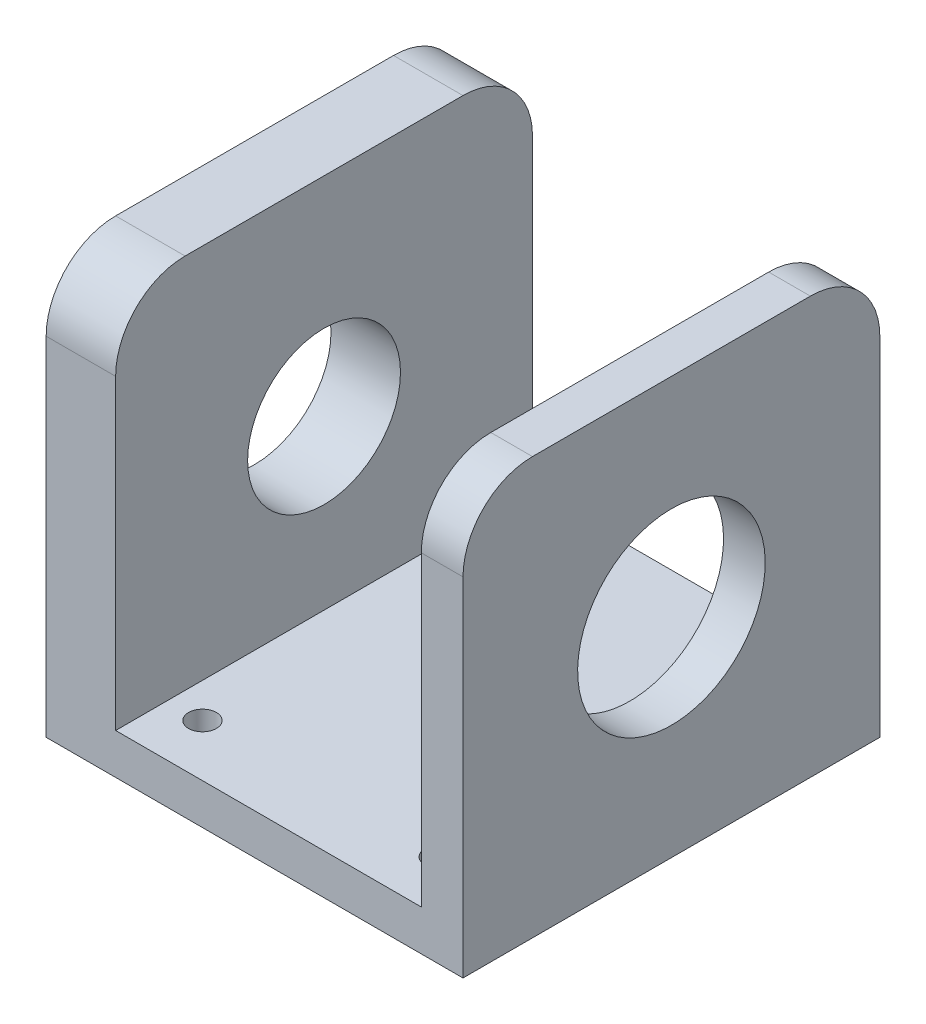
ISO-10303-21;
HEADER;
FILE_DESCRIPTION(('STEP AP214'),'2;1');
FILE_NAME('part.step','',(''),(''),'','','');
FILE_SCHEMA(('AUTOMOTIVE_DESIGN { 1 0 10303 214 1 1 1 1 }'));
ENDSEC;
DATA;
#1=APPLICATION_CONTEXT('core data for automotive mechanical design processes');
#2=APPLICATION_PROTOCOL_DEFINITION('international standard','automotive_design',2000,#1);
#3=PRODUCT_CONTEXT('',#1,'mechanical');
#4=PRODUCT('Part','Part','',(#3));
#5=PRODUCT_RELATED_PRODUCT_CATEGORY('part','',(#4));
#6=PRODUCT_DEFINITION_FORMATION('','',#4);
#7=PRODUCT_DEFINITION_CONTEXT('part definition',#1,'design');
#8=PRODUCT_DEFINITION('design','',#6,#7);
#9=PRODUCT_DEFINITION_SHAPE('','',#8);
#10=(LENGTH_UNIT() NAMED_UNIT(*) SI_UNIT(.MILLI.,.METRE.));
#11=(NAMED_UNIT(*) PLANE_ANGLE_UNIT() SI_UNIT($,.RADIAN.));
#12=(NAMED_UNIT(*) SI_UNIT($,.STERADIAN.) SOLID_ANGLE_UNIT());
#13=UNCERTAINTY_MEASURE_WITH_UNIT(LENGTH_MEASURE(1.E-05),#10,'distance_accuracy_value','');
#14=(GEOMETRIC_REPRESENTATION_CONTEXT(3) GLOBAL_UNCERTAINTY_ASSIGNED_CONTEXT((#13)) GLOBAL_UNIT_ASSIGNED_CONTEXT((#10,
#11,#12)) REPRESENTATION_CONTEXT('',''));
#15=CARTESIAN_POINT('',(0.,0.,0.));
#16=DIRECTION('',(0.,0.,1.));
#17=DIRECTION('',(1.,0.,0.));
#18=AXIS2_PLACEMENT_3D('',#15,#16,#17);
#19=CARTESIAN_POINT('',(-30.,30.,30.));
#20=DIRECTION('',(0.,-1.,0.));
#21=DIRECTION('',(1.,0.,0.));
#22=AXIS2_PLACEMENT_3D('',#19,#20,#21);
#23=PLANE('',#22);
#24=DIRECTION('',(0.,0.,-1.));
#25=VECTOR('',#24,1.);
#26=CARTESIAN_POINT('',(-20.,30.,30.));
#27=LINE('',#26,#25);
#28=CARTESIAN_POINT('',(-20.,30.,20.));
#29=VERTEX_POINT('',#28);
#30=CARTESIAN_POINT('',(-20.,30.,-20.));
#31=VERTEX_POINT('',#30);
#32=EDGE_CURVE('E162',#29,#31,#27,.T.);
#33=ORIENTED_EDGE('',*,*,#32,.T.);
#34=DIRECTION('',(-1.,0.,0.));
#35=VECTOR('',#34,1.);
#36=CARTESIAN_POINT('',(-30.,30.,-20.));
#37=LINE('',#36,#35);
#38=CARTESIAN_POINT('',(-30.,30.,-20.));
#39=VERTEX_POINT('',#38);
#40=EDGE_CURVE('E216',#31,#39,#37,.T.);
#41=ORIENTED_EDGE('',*,*,#40,.T.);
#42=DIRECTION('',(0.,0.,-1.));
#43=VECTOR('',#42,1.);
#44=CARTESIAN_POINT('',(-30.,30.,30.));
#45=LINE('',#44,#43);
#46=CARTESIAN_POINT('',(-30.,30.,20.));
#47=VERTEX_POINT('',#46);
#48=EDGE_CURVE('E145',#47,#39,#45,.T.);
#49=ORIENTED_EDGE('',*,*,#48,.F.);
#50=DIRECTION('',(-1.,0.,0.));
#51=VECTOR('',#50,1.);
#52=CARTESIAN_POINT('',(-30.,30.,20.));
#53=LINE('',#52,#51);
#54=EDGE_CURVE('E55',#47,#29,#53,.F.);
#55=ORIENTED_EDGE('',*,*,#54,.T.);
#56=EDGE_LOOP('',(#33,#41,#49,#55));
#57=FACE_BOUND('',#56,.T.);
#58=ADVANCED_FACE('F33',(#57),#23,.F.);
#59=CARTESIAN_POINT('',(-30.,30.,30.));
#60=DIRECTION('',(1.,0.,0.));
#61=DIRECTION('',(0.,1.,0.));
#62=AXIS2_PLACEMENT_3D('',#59,#60,#61);
#63=PLANE('',#62);
#64=CARTESIAN_POINT('',(-30.,0.,0.));
#65=DIRECTION('',(1.,0.,0.));
#66=DIRECTION('',(0.,1.,0.));
#67=AXIS2_PLACEMENT_3D('',#64,#65,#66);
#68=CIRCLE('',#67,11.);
#69=CARTESIAN_POINT('',(-30.,11.,0.));
#70=VERTEX_POINT('',#69);
#71=EDGE_CURVE('E165',#70,#70,#68,.T.);
#72=ORIENTED_EDGE('',*,*,#71,.T.);
#73=EDGE_LOOP('',(#72));
#74=FACE_BOUND('',#73,.T.);
#75=ORIENTED_EDGE('',*,*,#48,.T.);
#76=CARTESIAN_POINT('',(-30.,20.,-20.));
#77=DIRECTION('',(1.,0.,0.));
#78=DIRECTION('',(0.,1.,0.));
#79=AXIS2_PLACEMENT_3D('',#76,#77,#78);
#80=CIRCLE('',#79,10.);
#81=CARTESIAN_POINT('',(-30.,20.,-30.));
#82=VERTEX_POINT('',#81);
#83=EDGE_CURVE('E221',#39,#82,#80,.F.);
#84=ORIENTED_EDGE('',*,*,#83,.T.);
#85=DIRECTION('',(0.,-1.,0.));
#86=VECTOR('',#85,1.);
#87=CARTESIAN_POINT('',(-30.,30.,-30.));
#88=LINE('',#87,#86);
#89=CARTESIAN_POINT('',(-30.,-30.,-30.));
#90=VERTEX_POINT('',#89);
#91=EDGE_CURVE('E142',#82,#90,#88,.T.);
#92=ORIENTED_EDGE('',*,*,#91,.T.);
#93=DIRECTION('',(0.,0.,-1.));
#94=VECTOR('',#93,1.);
#95=CARTESIAN_POINT('',(-30.,-30.,30.));
#96=LINE('',#95,#94);
#97=CARTESIAN_POINT('',(-30.,-30.,30.));
#98=VERTEX_POINT('',#97);
#99=EDGE_CURVE('E138',#98,#90,#96,.T.);
#100=ORIENTED_EDGE('',*,*,#99,.F.);
#101=DIRECTION('',(0.,-1.,0.));
#102=VECTOR('',#101,1.);
#103=CARTESIAN_POINT('',(-30.,30.,30.));
#104=LINE('',#103,#102);
#105=CARTESIAN_POINT('',(-30.,20.,30.));
#106=VERTEX_POINT('',#105);
#107=EDGE_CURVE('E124',#106,#98,#104,.T.);
#108=ORIENTED_EDGE('',*,*,#107,.F.);
#109=CARTESIAN_POINT('',(-30.,20.,20.));
#110=DIRECTION('',(1.,0.,0.));
#111=DIRECTION('',(0.,1.,0.));
#112=AXIS2_PLACEMENT_3D('',#109,#110,#111);
#113=CIRCLE('',#112,10.);
#114=EDGE_CURVE('E219',#106,#47,#113,.F.);
#115=ORIENTED_EDGE('',*,*,#114,.T.);
#116=EDGE_LOOP('',(#75,#84,#92,#100,#108,#115));
#117=FACE_BOUND('',#116,.T.);
#118=ADVANCED_FACE('F140',(#74,#117),#63,.F.);
#119=CARTESIAN_POINT('',(-30.,-30.,30.));
#120=DIRECTION('',(0.,1.,0.));
#121=DIRECTION('',(0.,0.,1.));
#122=AXIS2_PLACEMENT_3D('',#119,#120,#121);
#123=PLANE('',#122);
#124=CARTESIAN_POINT('',(19.,-30.,-22.5));
#125=DIRECTION('',(0.,1.,0.));
#126=DIRECTION('',(0.,0.,1.));
#127=AXIS2_PLACEMENT_3D('',#124,#125,#126);
#128=CIRCLE('',#127,2.00000000000001);
#129=CARTESIAN_POINT('',(19.,-30.,-20.5));
#130=VERTEX_POINT('',#129);
#131=EDGE_CURVE('E193',#130,#130,#128,.T.);
#132=ORIENTED_EDGE('',*,*,#131,.T.);
#133=EDGE_LOOP('',(#132));
#134=FACE_BOUND('',#133,.T.);
#135=CARTESIAN_POINT('',(-15.,-30.,22.5));
#136=DIRECTION('',(0.,1.,0.));
#137=DIRECTION('',(0.,0.,1.));
#138=AXIS2_PLACEMENT_3D('',#135,#136,#137);
#139=CIRCLE('',#138,2.);
#140=CARTESIAN_POINT('',(-15.,-30.,24.5));
#141=VERTEX_POINT('',#140);
#142=EDGE_CURVE('E234',#141,#141,#139,.T.);
#143=ORIENTED_EDGE('',*,*,#142,.T.);
#144=EDGE_LOOP('',(#143));
#145=FACE_BOUND('',#144,.T.);
#146=CARTESIAN_POINT('',(19.,-30.,22.5));
#147=DIRECTION('',(0.,1.,0.));
#148=DIRECTION('',(0.,0.,1.));
#149=AXIS2_PLACEMENT_3D('',#146,#147,#148);
#150=CIRCLE('',#149,2.00000000000001);
#151=CARTESIAN_POINT('',(19.,-30.,24.5));
#152=VERTEX_POINT('',#151);
#153=EDGE_CURVE('E231',#152,#152,#150,.T.);
#154=ORIENTED_EDGE('',*,*,#153,.T.);
#155=EDGE_LOOP('',(#154));
#156=FACE_BOUND('',#155,.T.);
#157=CARTESIAN_POINT('',(-15.,-30.,-22.5));
#158=DIRECTION('',(0.,1.,0.));
#159=DIRECTION('',(0.,0.,1.));
#160=AXIS2_PLACEMENT_3D('',#157,#158,#159);
#161=CIRCLE('',#160,2.);
#162=CARTESIAN_POINT('',(-15.,-30.,-20.5));
#163=VERTEX_POINT('',#162);
#164=EDGE_CURVE('E227',#163,#163,#161,.T.);
#165=ORIENTED_EDGE('',*,*,#164,.T.);
#166=EDGE_LOOP('',(#165));
#167=FACE_BOUND('',#166,.T.);
#168=DIRECTION('',(1.,0.,0.));
#169=VECTOR('',#168,1.);
#170=CARTESIAN_POINT('',(-30.,-30.,-30.));
#171=LINE('',#170,#169);
#172=CARTESIAN_POINT('',(30.,-30.,-30.));
#173=VERTEX_POINT('',#172);
#174=EDGE_CURVE('E164',#90,#173,#171,.T.);
#175=ORIENTED_EDGE('',*,*,#174,.T.);
#176=DIRECTION('',(0.,0.,-1.));
#177=VECTOR('',#176,1.);
#178=CARTESIAN_POINT('',(30.,-30.,30.));
#179=LINE('',#178,#177);
#180=CARTESIAN_POINT('',(30.,-30.,30.));
#181=VERTEX_POINT('',#180);
#182=EDGE_CURVE('E146',#181,#173,#179,.T.);
#183=ORIENTED_EDGE('',*,*,#182,.F.);
#184=DIRECTION('',(1.,0.,0.));
#185=VECTOR('',#184,1.);
#186=CARTESIAN_POINT('',(-30.,-30.,30.));
#187=LINE('',#186,#185);
#188=EDGE_CURVE('E129',#98,#181,#187,.T.);
#189=ORIENTED_EDGE('',*,*,#188,.F.);
#190=ORIENTED_EDGE('',*,*,#99,.T.);
#191=EDGE_LOOP('',(#175,#183,#189,#190));
#192=FACE_BOUND('',#191,.T.);
#193=ADVANCED_FACE('F148',(#134,#145,#156,#167,#192),#123,.F.);
#194=CARTESIAN_POINT('',(30.,-30.,30.));
#195=DIRECTION('',(-1.,0.,0.));
#196=DIRECTION('',(0.,-1.,0.));
#197=AXIS2_PLACEMENT_3D('',#194,#195,#196);
#198=PLANE('',#197);
#199=CARTESIAN_POINT('',(30.,0.,0.));
#200=DIRECTION('',(1.,0.,0.));
#201=DIRECTION('',(0.,1.,0.));
#202=AXIS2_PLACEMENT_3D('',#199,#200,#201);
#203=CIRCLE('',#202,13.5);
#204=CARTESIAN_POINT('',(30.,13.5,0.));
#205=VERTEX_POINT('',#204);
#206=EDGE_CURVE('E340',#205,#205,#203,.T.);
#207=ORIENTED_EDGE('',*,*,#206,.F.);
#208=EDGE_LOOP('',(#207));
#209=FACE_BOUND('',#208,.T.);
#210=DIRECTION('',(0.,0.,-1.));
#211=VECTOR('',#210,1.);
#212=CARTESIAN_POINT('',(30.,30.,30.));
#213=LINE('',#212,#211);
#214=CARTESIAN_POINT('',(30.,30.,20.));
#215=VERTEX_POINT('',#214);
#216=CARTESIAN_POINT('',(30.,30.,-20.));
#217=VERTEX_POINT('',#216);
#218=EDGE_CURVE('E185',#215,#217,#213,.T.);
#219=ORIENTED_EDGE('',*,*,#218,.F.);
#220=CARTESIAN_POINT('',(30.,20.,20.));
#221=DIRECTION('',(-1.,0.,0.));
#222=DIRECTION('',(0.,-1.,0.));
#223=AXIS2_PLACEMENT_3D('',#220,#221,#222);
#224=CIRCLE('',#223,10.);
#225=CARTESIAN_POINT('',(30.,20.,30.));
#226=VERTEX_POINT('',#225);
#227=EDGE_CURVE('E209',#215,#226,#224,.F.);
#228=ORIENTED_EDGE('',*,*,#227,.T.);
#229=DIRECTION('',(0.,1.,0.));
#230=VECTOR('',#229,1.);
#231=CARTESIAN_POINT('',(30.,-30.,30.));
#232=LINE('',#231,#230);
#233=EDGE_CURVE('E151',#181,#226,#232,.T.);
#234=ORIENTED_EDGE('',*,*,#233,.F.);
#235=ORIENTED_EDGE('',*,*,#182,.T.);
#236=DIRECTION('',(0.,1.,0.));
#237=VECTOR('',#236,1.);
#238=CARTESIAN_POINT('',(30.,-30.,-30.));
#239=LINE('',#238,#237);
#240=CARTESIAN_POINT('',(30.,20.,-30.));
#241=VERTEX_POINT('',#240);
#242=EDGE_CURVE('E167',#173,#241,#239,.T.);
#243=ORIENTED_EDGE('',*,*,#242,.T.);
#244=CARTESIAN_POINT('',(30.,20.,-20.));
#245=DIRECTION('',(-1.,0.,0.));
#246=DIRECTION('',(0.,-1.,0.));
#247=AXIS2_PLACEMENT_3D('',#244,#245,#246);
#248=CIRCLE('',#247,10.);
#249=EDGE_CURVE('E207',#241,#217,#248,.F.);
#250=ORIENTED_EDGE('',*,*,#249,.T.);
#251=EDGE_LOOP('',(#219,#228,#234,#235,#243,#250));
#252=FACE_BOUND('',#251,.T.);
#253=ADVANCED_FACE('F304',(#209,#252),#198,.F.);
#254=CARTESIAN_POINT('',(24.,30.,30.));
#255=DIRECTION('',(0.,-1.,0.));
#256=DIRECTION('',(0.,0.,-1.));
#257=AXIS2_PLACEMENT_3D('',#254,#255,#256);
#258=PLANE('',#257);
#259=DIRECTION('',(0.,0.,-1.));
#260=VECTOR('',#259,1.);
#261=CARTESIAN_POINT('',(24.,30.,30.));
#262=LINE('',#261,#260);
#263=CARTESIAN_POINT('',(24.,30.,20.));
#264=VERTEX_POINT('',#263);
#265=CARTESIAN_POINT('',(24.,30.,-20.));
#266=VERTEX_POINT('',#265);
#267=EDGE_CURVE('E182',#264,#266,#262,.T.);
#268=ORIENTED_EDGE('',*,*,#267,.F.);
#269=DIRECTION('',(-1.,0.,0.));
#270=VECTOR('',#269,1.);
#271=CARTESIAN_POINT('',(24.,30.,20.));
#272=LINE('',#271,#270);
#273=EDGE_CURVE('E205',#264,#215,#272,.F.);
#274=ORIENTED_EDGE('',*,*,#273,.T.);
#275=ORIENTED_EDGE('',*,*,#218,.T.);
#276=DIRECTION('',(-1.,0.,0.));
#277=VECTOR('',#276,1.);
#278=CARTESIAN_POINT('',(24.,30.,-20.));
#279=LINE('',#278,#277);
#280=EDGE_CURVE('E202',#217,#266,#279,.T.);
#281=ORIENTED_EDGE('',*,*,#280,.T.);
#282=EDGE_LOOP('',(#268,#274,#275,#281));
#283=FACE_BOUND('',#282,.T.);
#284=ADVANCED_FACE('F313',(#283),#258,.F.);
#285=CARTESIAN_POINT('',(24.,-24.1479454827235,30.));
#286=DIRECTION('',(1.,0.,0.));
#287=DIRECTION('',(0.,1.,0.));
#288=AXIS2_PLACEMENT_3D('',#285,#286,#287);
#289=PLANE('',#288);
#290=CARTESIAN_POINT('',(24.,0.,0.));
#291=DIRECTION('',(1.,0.,0.));
#292=DIRECTION('',(0.,1.,0.));
#293=AXIS2_PLACEMENT_3D('',#290,#291,#292);
#294=CIRCLE('',#293,13.5);
#295=CARTESIAN_POINT('',(24.,13.5,0.));
#296=VERTEX_POINT('',#295);
#297=EDGE_CURVE('E37',#296,#296,#294,.T.);
#298=ORIENTED_EDGE('',*,*,#297,.T.);
#299=EDGE_LOOP('',(#298));
#300=FACE_BOUND('',#299,.T.);
#301=DIRECTION('',(0.,-1.,0.));
#302=VECTOR('',#301,1.);
#303=CARTESIAN_POINT('',(24.,-24.1479454827235,30.));
#304=LINE('',#303,#302);
#305=CARTESIAN_POINT('',(24.,20.,30.));
#306=VERTEX_POINT('',#305);
#307=CARTESIAN_POINT('',(24.,-24.1479454827235,30.));
#308=VERTEX_POINT('',#307);
#309=EDGE_CURVE('E153',#306,#308,#304,.T.);
#310=ORIENTED_EDGE('',*,*,#309,.F.);
#311=CARTESIAN_POINT('',(24.,20.,20.));
#312=DIRECTION('',(1.,0.,0.));
#313=DIRECTION('',(0.,1.,0.));
#314=AXIS2_PLACEMENT_3D('',#311,#312,#313);
#315=CIRCLE('',#314,10.);
#316=EDGE_CURVE('E200',#306,#264,#315,.F.);
#317=ORIENTED_EDGE('',*,*,#316,.T.);
#318=ORIENTED_EDGE('',*,*,#267,.T.);
#319=CARTESIAN_POINT('',(24.,20.,-20.));
#320=DIRECTION('',(1.,0.,0.));
#321=DIRECTION('',(0.,1.,0.));
#322=AXIS2_PLACEMENT_3D('',#319,#320,#321);
#323=CIRCLE('',#322,10.);
#324=CARTESIAN_POINT('',(24.,20.,-30.));
#325=VERTEX_POINT('',#324);
#326=EDGE_CURVE('E198',#266,#325,#323,.F.);
#327=ORIENTED_EDGE('',*,*,#326,.T.);
#328=DIRECTION('',(0.,-1.,0.));
#329=VECTOR('',#328,1.);
#330=CARTESIAN_POINT('',(24.,-24.1479454827235,-30.));
#331=LINE('',#330,#329);
#332=CARTESIAN_POINT('',(24.,-24.1479454827235,-30.));
#333=VERTEX_POINT('',#332);
#334=EDGE_CURVE('E170',#325,#333,#331,.T.);
#335=ORIENTED_EDGE('',*,*,#334,.T.);
#336=DIRECTION('',(0.,0.,-1.));
#337=VECTOR('',#336,1.);
#338=CARTESIAN_POINT('',(24.,-24.1479454827235,30.));
#339=LINE('',#338,#337);
#340=EDGE_CURVE('E179',#308,#333,#339,.T.);
#341=ORIENTED_EDGE('',*,*,#340,.F.);
#342=EDGE_LOOP('',(#310,#317,#318,#327,#335,#341));
#343=FACE_BOUND('',#342,.T.);
#344=ADVANCED_FACE('F311',(#300,#343),#289,.F.);
#345=CARTESIAN_POINT('',(-20.,-24.1479454827235,30.));
#346=DIRECTION('',(0.,-1.,0.));
#347=DIRECTION('',(0.,0.,-1.));
#348=AXIS2_PLACEMENT_3D('',#345,#346,#347);
#349=PLANE('',#348);
#350=CARTESIAN_POINT('',(19.,-24.1479454827235,-22.5));
#351=DIRECTION('',(0.,-1.,0.));
#352=DIRECTION('',(0.,0.,-1.));
#353=AXIS2_PLACEMENT_3D('',#350,#351,#352);
#354=CIRCLE('',#353,2.00000000000001);
#355=CARTESIAN_POINT('',(19.,-24.1479454827235,-24.5));
#356=VERTEX_POINT('',#355);
#357=EDGE_CURVE('E235',#356,#356,#354,.T.);
#358=ORIENTED_EDGE('',*,*,#357,.T.);
#359=EDGE_LOOP('',(#358));
#360=FACE_BOUND('',#359,.T.);
#361=CARTESIAN_POINT('',(-15.,-24.1479454827235,22.5));
#362=DIRECTION('',(0.,-1.,0.));
#363=DIRECTION('',(0.,0.,-1.));
#364=AXIS2_PLACEMENT_3D('',#361,#362,#363);
#365=CIRCLE('',#364,2.);
#366=CARTESIAN_POINT('',(-15.,-24.1479454827235,20.5));
#367=VERTEX_POINT('',#366);
#368=EDGE_CURVE('E232',#367,#367,#365,.T.);
#369=ORIENTED_EDGE('',*,*,#368,.T.);
#370=EDGE_LOOP('',(#369));
#371=FACE_BOUND('',#370,.T.);
#372=CARTESIAN_POINT('',(19.,-24.1479454827235,22.5));
#373=DIRECTION('',(0.,-1.,0.));
#374=DIRECTION('',(0.,0.,-1.));
#375=AXIS2_PLACEMENT_3D('',#372,#373,#374);
#376=CIRCLE('',#375,2.00000000000001);
#377=CARTESIAN_POINT('',(19.,-24.1479454827235,20.5));
#378=VERTEX_POINT('',#377);
#379=EDGE_CURVE('E228',#378,#378,#376,.T.);
#380=ORIENTED_EDGE('',*,*,#379,.T.);
#381=EDGE_LOOP('',(#380));
#382=FACE_BOUND('',#381,.T.);
#383=CARTESIAN_POINT('',(-15.,-24.1479454827235,-22.5));
#384=DIRECTION('',(0.,-1.,0.));
#385=DIRECTION('',(0.,0.,-1.));
#386=AXIS2_PLACEMENT_3D('',#383,#384,#385);
#387=CIRCLE('',#386,2.);
#388=CARTESIAN_POINT('',(-15.,-24.1479454827235,-24.5));
#389=VERTEX_POINT('',#388);
#390=EDGE_CURVE('E224',#389,#389,#387,.T.);
#391=ORIENTED_EDGE('',*,*,#390,.T.);
#392=EDGE_LOOP('',(#391));
#393=FACE_BOUND('',#392,.T.);
#394=DIRECTION('',(-1.,0.,0.));
#395=VECTOR('',#394,1.);
#396=CARTESIAN_POINT('',(-20.,-24.1479454827235,-30.));
#397=LINE('',#396,#395);
#398=CARTESIAN_POINT('',(-20.,-24.1479454827235,-30.));
#399=VERTEX_POINT('',#398);
#400=EDGE_CURVE('E172',#333,#399,#397,.T.);
#401=ORIENTED_EDGE('',*,*,#400,.T.);
#402=DIRECTION('',(0.,0.,-1.));
#403=VECTOR('',#402,1.);
#404=CARTESIAN_POINT('',(-20.,-24.1479454827235,30.));
#405=LINE('',#404,#403);
#406=CARTESIAN_POINT('',(-20.,-24.1479454827235,30.));
#407=VERTEX_POINT('',#406);
#408=EDGE_CURVE('E176',#407,#399,#405,.T.);
#409=ORIENTED_EDGE('',*,*,#408,.F.);
#410=DIRECTION('',(-1.,0.,0.));
#411=VECTOR('',#410,1.);
#412=CARTESIAN_POINT('',(-20.,-24.1479454827235,30.));
#413=LINE('',#412,#411);
#414=EDGE_CURVE('E158',#308,#407,#413,.T.);
#415=ORIENTED_EDGE('',*,*,#414,.F.);
#416=ORIENTED_EDGE('',*,*,#340,.T.);
#417=EDGE_LOOP('',(#401,#409,#415,#416));
#418=FACE_BOUND('',#417,.T.);
#419=ADVANCED_FACE('F297',(#360,#371,#382,#393,#418),#349,.F.);
#420=CARTESIAN_POINT('',(-20.,30.,30.));
#421=DIRECTION('',(-1.,0.,0.));
#422=DIRECTION('',(0.,-1.,0.));
#423=AXIS2_PLACEMENT_3D('',#420,#421,#422);
#424=PLANE('',#423);
#425=CARTESIAN_POINT('',(-20.,0.,0.));
#426=DIRECTION('',(-1.,0.,0.));
#427=DIRECTION('',(0.,-1.,0.));
#428=AXIS2_PLACEMENT_3D('',#425,#426,#427);
#429=CIRCLE('',#428,11.);
#430=CARTESIAN_POINT('',(-20.,-11.,0.));
#431=VERTEX_POINT('',#430);
#432=EDGE_CURVE('E190',#431,#431,#429,.T.);
#433=ORIENTED_EDGE('',*,*,#432,.T.);
#434=EDGE_LOOP('',(#433));
#435=FACE_BOUND('',#434,.T.);
#436=DIRECTION('',(0.,1.,0.));
#437=VECTOR('',#436,1.);
#438=CARTESIAN_POINT('',(-20.,30.,-30.));
#439=LINE('',#438,#437);
#440=CARTESIAN_POINT('',(-20.,20.,-30.));
#441=VERTEX_POINT('',#440);
#442=EDGE_CURVE('E135',#399,#441,#439,.T.);
#443=ORIENTED_EDGE('',*,*,#442,.T.);
#444=CARTESIAN_POINT('',(-20.,20.,-20.));
#445=DIRECTION('',(-1.,0.,0.));
#446=DIRECTION('',(0.,-1.,0.));
#447=AXIS2_PLACEMENT_3D('',#444,#445,#446);
#448=CIRCLE('',#447,10.);
#449=EDGE_CURVE('E11',#441,#31,#448,.F.);
#450=ORIENTED_EDGE('',*,*,#449,.T.);
#451=ORIENTED_EDGE('',*,*,#32,.F.);
#452=CARTESIAN_POINT('',(-20.,20.,20.));
#453=DIRECTION('',(-1.,0.,0.));
#454=DIRECTION('',(0.,-1.,0.));
#455=AXIS2_PLACEMENT_3D('',#452,#453,#454);
#456=CIRCLE('',#455,10.);
#457=CARTESIAN_POINT('',(-20.,20.,30.));
#458=VERTEX_POINT('',#457);
#459=EDGE_CURVE('E42',#29,#458,#456,.F.);
#460=ORIENTED_EDGE('',*,*,#459,.T.);
#461=DIRECTION('',(0.,1.,0.));
#462=VECTOR('',#461,1.);
#463=CARTESIAN_POINT('',(-20.,30.,30.));
#464=LINE('',#463,#462);
#465=EDGE_CURVE('E160',#407,#458,#464,.T.);
#466=ORIENTED_EDGE('',*,*,#465,.F.);
#467=ORIENTED_EDGE('',*,*,#408,.T.);
#468=EDGE_LOOP('',(#443,#450,#451,#460,#466,#467));
#469=FACE_BOUND('',#468,.T.);
#470=ADVANCED_FACE('F291',(#435,#469),#424,.F.);
#471=CARTESIAN_POINT('',(0.,0.,30.));
#472=DIRECTION('',(0.,0.,-1.));
#473=DIRECTION('',(-1.,0.,0.));
#474=AXIS2_PLACEMENT_3D('',#471,#472,#473);
#475=PLANE('',#474);
#476=ORIENTED_EDGE('',*,*,#233,.T.);
#477=DIRECTION('',(-1.,0.,0.));
#478=VECTOR('',#477,1.);
#479=CARTESIAN_POINT('',(0.,20.,30.));
#480=LINE('',#479,#478);
#481=EDGE_CURVE('E195',#226,#306,#480,.T.);
#482=ORIENTED_EDGE('',*,*,#481,.T.);
#483=ORIENTED_EDGE('',*,*,#309,.T.);
#484=ORIENTED_EDGE('',*,*,#414,.T.);
#485=ORIENTED_EDGE('',*,*,#465,.T.);
#486=DIRECTION('',(-1.,0.,0.));
#487=VECTOR('',#486,1.);
#488=CARTESIAN_POINT('',(0.,20.,30.));
#489=LINE('',#488,#487);
#490=EDGE_CURVE('E133',#458,#106,#489,.T.);
#491=ORIENTED_EDGE('',*,*,#490,.T.);
#492=ORIENTED_EDGE('',*,*,#107,.T.);
#493=ORIENTED_EDGE('',*,*,#188,.T.);
#494=EDGE_LOOP('',(#476,#482,#483,#484,#485,#491,#492,#493));
#495=FACE_BOUND('',#494,.T.);
#496=ADVANCED_FACE('F127',(#495),#475,.F.);
#497=CARTESIAN_POINT('',(0.,0.,-30.));
#498=DIRECTION('',(0.,0.,-1.));
#499=DIRECTION('',(-1.,0.,0.));
#500=AXIS2_PLACEMENT_3D('',#497,#498,#499);
#501=PLANE('',#500);
#502=ORIENTED_EDGE('',*,*,#334,.F.);
#503=DIRECTION('',(-1.,0.,0.));
#504=VECTOR('',#503,1.);
#505=CARTESIAN_POINT('',(30.,20.,-30.));
#506=LINE('',#505,#504);
#507=EDGE_CURVE('E213',#325,#241,#506,.F.);
#508=ORIENTED_EDGE('',*,*,#507,.T.);
#509=ORIENTED_EDGE('',*,*,#242,.F.);
#510=ORIENTED_EDGE('',*,*,#174,.F.);
#511=ORIENTED_EDGE('',*,*,#91,.F.);
#512=DIRECTION('',(-1.,0.,0.));
#513=VECTOR('',#512,1.);
#514=CARTESIAN_POINT('',(-20.,20.,-30.));
#515=LINE('',#514,#513);
#516=EDGE_CURVE('E211',#82,#441,#515,.F.);
#517=ORIENTED_EDGE('',*,*,#516,.T.);
#518=ORIENTED_EDGE('',*,*,#442,.F.);
#519=ORIENTED_EDGE('',*,*,#400,.F.);
#520=EDGE_LOOP('',(#502,#508,#509,#510,#511,#517,#518,#519));
#521=FACE_BOUND('',#520,.T.);
#522=ADVANCED_FACE('F254',(#521),#501,.T.);
#523=CARTESIAN_POINT('',(-60.,0.,0.));
#524=DIRECTION('',(1.,0.,0.));
#525=DIRECTION('',(0.,0.,-1.));
#526=AXIS2_PLACEMENT_3D('',#523,#524,#525);
#527=CYLINDRICAL_SURFACE('',#526,11.);
#528=ORIENTED_EDGE('',*,*,#432,.F.);
#529=EDGE_LOOP('',(#528));
#530=FACE_BOUND('',#529,.T.);
#531=ORIENTED_EDGE('',*,*,#71,.F.);
#532=EDGE_LOOP('',(#531));
#533=FACE_BOUND('',#532,.T.);
#534=ADVANCED_FACE('F251',(#530,#533),#527,.F.);
#535=CARTESIAN_POINT('',(0.,20.,20.));
#536=DIRECTION('',(-1.,0.,0.));
#537=DIRECTION('',(0.,0.,1.));
#538=AXIS2_PLACEMENT_3D('',#535,#536,#537);
#539=CYLINDRICAL_SURFACE('',#538,10.);
#540=ORIENTED_EDGE('',*,*,#227,.F.);
#541=ORIENTED_EDGE('',*,*,#273,.F.);
#542=ORIENTED_EDGE('',*,*,#316,.F.);
#543=ORIENTED_EDGE('',*,*,#481,.F.);
#544=EDGE_LOOP('',(#540,#541,#542,#543));
#545=FACE_BOUND('',#544,.T.);
#546=ADVANCED_FACE('F253',(#545),#539,.T.);
#547=CARTESIAN_POINT('',(24.,20.,-20.));
#548=DIRECTION('',(1.,0.,0.));
#549=DIRECTION('',(0.,0.,-1.));
#550=AXIS2_PLACEMENT_3D('',#547,#548,#549);
#551=CYLINDRICAL_SURFACE('',#550,10.);
#552=ORIENTED_EDGE('',*,*,#249,.F.);
#553=ORIENTED_EDGE('',*,*,#507,.F.);
#554=ORIENTED_EDGE('',*,*,#326,.F.);
#555=ORIENTED_EDGE('',*,*,#280,.F.);
#556=EDGE_LOOP('',(#552,#553,#554,#555));
#557=FACE_BOUND('',#556,.T.);
#558=ADVANCED_FACE('F261',(#557),#551,.T.);
#559=CARTESIAN_POINT('',(-30.,20.,-20.));
#560=DIRECTION('',(1.,0.,0.));
#561=DIRECTION('',(0.,1.,0.));
#562=AXIS2_PLACEMENT_3D('',#559,#560,#561);
#563=CYLINDRICAL_SURFACE('',#562,10.);
#564=ORIENTED_EDGE('',*,*,#449,.F.);
#565=ORIENTED_EDGE('',*,*,#516,.F.);
#566=ORIENTED_EDGE('',*,*,#83,.F.);
#567=ORIENTED_EDGE('',*,*,#40,.F.);
#568=EDGE_LOOP('',(#564,#565,#566,#567));
#569=FACE_BOUND('',#568,.T.);
#570=ADVANCED_FACE('F278',(#569),#563,.T.);
#571=CARTESIAN_POINT('',(0.,20.,20.));
#572=DIRECTION('',(-1.,0.,0.));
#573=DIRECTION('',(0.,-1.,0.));
#574=AXIS2_PLACEMENT_3D('',#571,#572,#573);
#575=CYLINDRICAL_SURFACE('',#574,10.);
#576=ORIENTED_EDGE('',*,*,#459,.F.);
#577=ORIENTED_EDGE('',*,*,#54,.F.);
#578=ORIENTED_EDGE('',*,*,#114,.F.);
#579=ORIENTED_EDGE('',*,*,#490,.F.);
#580=EDGE_LOOP('',(#576,#577,#578,#579));
#581=FACE_BOUND('',#580,.T.);
#582=ADVANCED_FACE('F35',(#581),#575,.T.);
#583=CARTESIAN_POINT('',(-15.,-34.1479454827235,-22.5));
#584=DIRECTION('',(0.,1.,0.));
#585=DIRECTION('',(0.,0.,1.));
#586=AXIS2_PLACEMENT_3D('',#583,#584,#585);
#587=CYLINDRICAL_SURFACE('',#586,2.);
#588=ORIENTED_EDGE('',*,*,#390,.F.);
#589=EDGE_LOOP('',(#588));
#590=FACE_BOUND('',#589,.T.);
#591=ORIENTED_EDGE('',*,*,#164,.F.);
#592=EDGE_LOOP('',(#591));
#593=FACE_BOUND('',#592,.T.);
#594=ADVANCED_FACE('F285',(#590,#593),#587,.F.);
#595=CARTESIAN_POINT('',(19.,-34.1479454827235,22.5));
#596=DIRECTION('',(0.,1.,0.));
#597=DIRECTION('',(0.,0.,1.));
#598=AXIS2_PLACEMENT_3D('',#595,#596,#597);
#599=CYLINDRICAL_SURFACE('',#598,2.00000000000001);
#600=ORIENTED_EDGE('',*,*,#379,.F.);
#601=EDGE_LOOP('',(#600));
#602=FACE_BOUND('',#601,.T.);
#603=ORIENTED_EDGE('',*,*,#153,.F.);
#604=EDGE_LOOP('',(#603));
#605=FACE_BOUND('',#604,.T.);
#606=ADVANCED_FACE('F358',(#602,#605),#599,.F.);
#607=CARTESIAN_POINT('',(-15.,-34.1479454827235,22.5));
#608=DIRECTION('',(0.,1.,0.));
#609=DIRECTION('',(0.,0.,1.));
#610=AXIS2_PLACEMENT_3D('',#607,#608,#609);
#611=CYLINDRICAL_SURFACE('',#610,2.);
#612=ORIENTED_EDGE('',*,*,#368,.F.);
#613=EDGE_LOOP('',(#612));
#614=FACE_BOUND('',#613,.T.);
#615=ORIENTED_EDGE('',*,*,#142,.F.);
#616=EDGE_LOOP('',(#615));
#617=FACE_BOUND('',#616,.T.);
#618=ADVANCED_FACE('F354',(#614,#617),#611,.F.);
#619=CARTESIAN_POINT('',(19.,-34.1479454827235,-22.5));
#620=DIRECTION('',(0.,1.,0.));
#621=DIRECTION('',(0.,0.,1.));
#622=AXIS2_PLACEMENT_3D('',#619,#620,#621);
#623=CYLINDRICAL_SURFACE('',#622,2.00000000000001);
#624=ORIENTED_EDGE('',*,*,#357,.F.);
#625=EDGE_LOOP('',(#624));
#626=FACE_BOUND('',#625,.T.);
#627=ORIENTED_EDGE('',*,*,#131,.F.);
#628=EDGE_LOOP('',(#627));
#629=FACE_BOUND('',#628,.T.);
#630=ADVANCED_FACE('F349',(#626,#629),#623,.F.);
#631=CARTESIAN_POINT('',(20.,0.,0.));
#632=DIRECTION('',(1.,0.,0.));
#633=DIRECTION('',(0.,1.,0.));
#634=AXIS2_PLACEMENT_3D('',#631,#632,#633);
#635=CYLINDRICAL_SURFACE('',#634,13.5);
#636=ORIENTED_EDGE('',*,*,#206,.T.);
#637=EDGE_LOOP('',(#636));
#638=FACE_BOUND('',#637,.T.);
#639=ORIENTED_EDGE('',*,*,#297,.F.);
#640=EDGE_LOOP('',(#639));
#641=FACE_BOUND('',#640,.T.);
#642=ADVANCED_FACE('F347',(#638,#641),#635,.F.);
#643=CLOSED_SHELL('',(#58,#118,#193,#253,#284,#344,#419,#470,#496,#522,#534,#546,#558,#570,#582,
#594,#606,#618,#630,#642));
#644=MANIFOLD_SOLID_BREP('B2',#643);
#645=ADVANCED_BREP_SHAPE_REPRESENTATION('',(#18,#644),#14);
#646=SHAPE_DEFINITION_REPRESENTATION(#9,#645);
ENDSEC;
END-ISO-10303-21;
